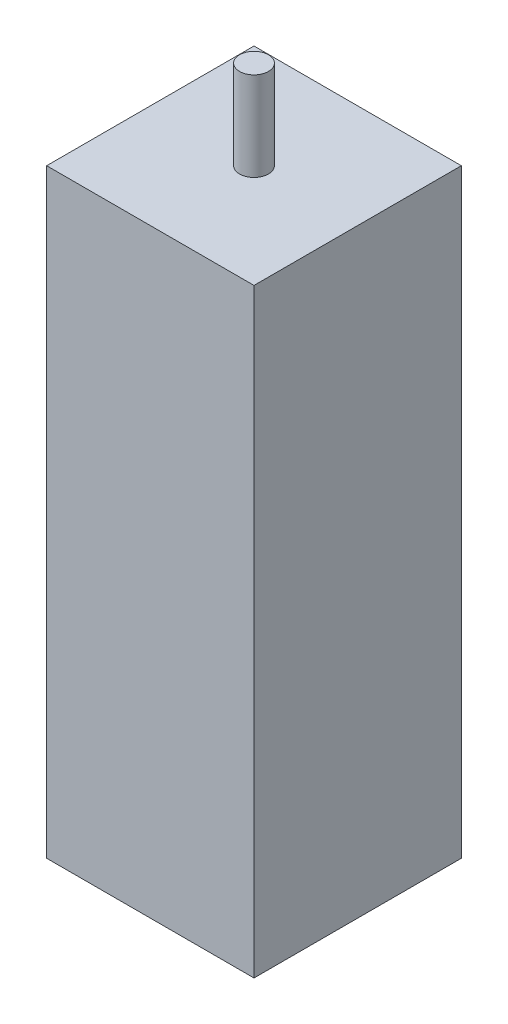
ISO-10303-21;
HEADER;
FILE_DESCRIPTION(('STEP AP214'),'2;1');
FILE_NAME('part.step','',(''),(''),'','','');
FILE_SCHEMA(('AUTOMOTIVE_DESIGN { 1 0 10303 214 1 1 1 1 }'));
ENDSEC;
DATA;
#1=APPLICATION_CONTEXT('core data for automotive mechanical design processes');
#2=APPLICATION_PROTOCOL_DEFINITION('international standard','automotive_design',2000,#1);
#3=PRODUCT_CONTEXT('',#1,'mechanical');
#4=PRODUCT('Part','Part','',(#3));
#5=PRODUCT_RELATED_PRODUCT_CATEGORY('part','',(#4));
#6=PRODUCT_DEFINITION_FORMATION('','',#4);
#7=PRODUCT_DEFINITION_CONTEXT('part definition',#1,'design');
#8=PRODUCT_DEFINITION('design','',#6,#7);
#9=PRODUCT_DEFINITION_SHAPE('','',#8);
#10=(LENGTH_UNIT() NAMED_UNIT(*) SI_UNIT(.MILLI.,.METRE.));
#11=(NAMED_UNIT(*) PLANE_ANGLE_UNIT() SI_UNIT($,.RADIAN.));
#12=(NAMED_UNIT(*) SI_UNIT($,.STERADIAN.) SOLID_ANGLE_UNIT());
#13=UNCERTAINTY_MEASURE_WITH_UNIT(LENGTH_MEASURE(1.E-05),#10,'distance_accuracy_value','');
#14=(GEOMETRIC_REPRESENTATION_CONTEXT(3) GLOBAL_UNCERTAINTY_ASSIGNED_CONTEXT((#13)) GLOBAL_UNIT_ASSIGNED_CONTEXT((#10,
#11,#12)) REPRESENTATION_CONTEXT('',''));
#15=CARTESIAN_POINT('',(0.,0.,0.));
#16=DIRECTION('',(0.,0.,1.));
#17=DIRECTION('',(1.,0.,0.));
#18=AXIS2_PLACEMENT_3D('',#15,#16,#17);
#19=CARTESIAN_POINT('',(29.0000000745058,71.,71.0000014156103));
#20=DIRECTION('',(0.,1.,0.));
#21=DIRECTION('',(1.,0.,0.));
#22=AXIS2_PLACEMENT_3D('',#19,#20,#21);
#23=PLANE('',#22);
#24=CARTESIAN_POINT('',(29.0000000745058,71.,71.0000014156103));
#25=DIRECTION('',(0.,-1.,0.));
#26=DIRECTION('',(-1.,0.,0.));
#27=AXIS2_PLACEMENT_3D('',#24,#25,#26);
#28=CIRCLE('',#27,3.);
#29=CARTESIAN_POINT('',(32.0000000745058,71.,71.0000014156103));
#30=VERTEX_POINT('',#29);
#31=EDGE_CURVE('E162',#30,#30,#28,.T.);
#32=ORIENTED_EDGE('',*,*,#31,.F.);
#33=EDGE_LOOP('',(#32));
#34=FACE_BOUND('',#33,.T.);
#35=CARTESIAN_POINT('',(29.0000000745058,71.,71.0000014156103));
#36=DIRECTION('',(0.,1.,0.));
#37=DIRECTION('',(-1.,0.,0.));
#38=AXIS2_PLACEMENT_3D('',#35,#36,#37);
#39=CIRCLE('',#38,8.5);
#40=CARTESIAN_POINT('',(37.5000000745058,71.,71.0000014156103));
#41=VERTEX_POINT('',#40);
#42=EDGE_CURVE('E11',#41,#41,#39,.T.);
#43=ORIENTED_EDGE('',*,*,#42,.F.);
#44=EDGE_LOOP('',(#43));
#45=FACE_BOUND('',#44,.T.);
#46=ADVANCED_FACE('F17',(#34,#45),#23,.F.);
#47=CARTESIAN_POINT('',(29.0000000745058,71.,71.0000014156103));
#48=DIRECTION('',(0.,1.,0.));
#49=DIRECTION('',(-1.,0.,0.));
#50=AXIS2_PLACEMENT_3D('',#47,#48,#49);
#51=CYLINDRICAL_SURFACE('',#50,8.5);
#52=CARTESIAN_POINT('',(29.0000000745058,73.,71.0000014156103));
#53=DIRECTION('',(0.,1.,0.));
#54=DIRECTION('',(-1.,0.,0.));
#55=AXIS2_PLACEMENT_3D('',#52,#53,#54);
#56=CIRCLE('',#55,8.5);
#57=CARTESIAN_POINT('',(37.5000000745058,73.,71.0000014156103));
#58=VERTEX_POINT('',#57);
#59=EDGE_CURVE('E123',#58,#58,#56,.T.);
#60=ORIENTED_EDGE('',*,*,#59,.F.);
#61=DIRECTION('',(0.,-1.,0.));
#62=VECTOR('',#61,1.);
#63=CARTESIAN_POINT('',(37.5000000745058,71.,71.0000014156103));
#64=LINE('',#63,#62);
#65=EDGE_CURVE('E28',#58,#41,#64,.T.);
#66=ORIENTED_EDGE('',*,*,#65,.T.);
#67=ORIENTED_EDGE('',*,*,#42,.T.);
#68=ORIENTED_EDGE('',*,*,#65,.F.);
#69=EDGE_LOOP('',(#60,#66,#67,#68));
#70=FACE_BOUND('',#69,.T.);
#71=ADVANCED_FACE('F181',(#70),#51,.T.);
#72=CARTESIAN_POINT('',(29.0000000745058,71.,71.0000014156103));
#73=DIRECTION('',(0.,1.,0.));
#74=DIRECTION('',(-1.,0.,0.));
#75=AXIS2_PLACEMENT_3D('',#72,#73,#74);
#76=CYLINDRICAL_SURFACE('',#75,3.);
#77=ORIENTED_EDGE('',*,*,#31,.T.);
#78=DIRECTION('',(0.,1.,0.));
#79=VECTOR('',#78,1.);
#80=CARTESIAN_POINT('',(32.0000000745058,71.,71.0000014156103));
#81=LINE('',#80,#79);
#82=CARTESIAN_POINT('',(32.0000000745058,73.,71.0000014156103));
#83=VERTEX_POINT('',#82);
#84=EDGE_CURVE('E21',#30,#83,#81,.T.);
#85=ORIENTED_EDGE('',*,*,#84,.T.);
#86=CARTESIAN_POINT('',(29.0000000745058,73.,71.0000014156103));
#87=DIRECTION('',(0.,-1.,0.));
#88=DIRECTION('',(-1.,0.,0.));
#89=AXIS2_PLACEMENT_3D('',#86,#87,#88);
#90=CIRCLE('',#89,3.);
#91=EDGE_CURVE('E144',#83,#83,#90,.T.);
#92=ORIENTED_EDGE('',*,*,#91,.F.);
#93=ORIENTED_EDGE('',*,*,#84,.F.);
#94=EDGE_LOOP('',(#77,#85,#92,#93));
#95=FACE_BOUND('',#94,.T.);
#96=ADVANCED_FACE('F183',(#95),#76,.F.);
#97=CARTESIAN_POINT('',(29.0000000745058,154.,71.0000014156103));
#98=DIRECTION('',(0.,1.,0.));
#99=DIRECTION('',(1.,0.,0.));
#100=AXIS2_PLACEMENT_3D('',#97,#98,#99);
#101=PLANE('',#100);
#102=CARTESIAN_POINT('',(29.0000000745058,154.,71.0000014156103));
#103=DIRECTION('',(0.,-1.,0.));
#104=DIRECTION('',(-1.,0.,0.));
#105=AXIS2_PLACEMENT_3D('',#102,#103,#104);
#106=CIRCLE('',#105,1.95);
#107=CARTESIAN_POINT('',(30.9500000745058,154.,71.0000014156103));
#108=VERTEX_POINT('',#107);
#109=EDGE_CURVE('E78',#108,#108,#106,.T.);
#110=ORIENTED_EDGE('',*,*,#109,.T.);
#111=EDGE_LOOP('',(#110));
#112=FACE_BOUND('',#111,.T.);
#113=DIRECTION('',(0.,0.,1.));
#114=VECTOR('',#113,1.);
#115=CARTESIAN_POINT('',(15.0000000745058,154.,57.0000014156103));
#116=LINE('',#115,#114);
#117=CARTESIAN_POINT('',(15.0000000745058,154.,57.0000014156103));
#118=VERTEX_POINT('',#117);
#119=CARTESIAN_POINT('',(15.0000000745058,154.,85.0000014156103));
#120=VERTEX_POINT('',#119);
#121=EDGE_CURVE('E143',#118,#120,#116,.T.);
#122=ORIENTED_EDGE('',*,*,#121,.T.);
#123=DIRECTION('',(1.,0.,0.));
#124=VECTOR('',#123,1.);
#125=CARTESIAN_POINT('',(15.0000000745058,154.,85.0000014156103));
#126=LINE('',#125,#124);
#127=CARTESIAN_POINT('',(43.0000000745058,154.,85.0000014156103));
#128=VERTEX_POINT('',#127);
#129=EDGE_CURVE('E113',#120,#128,#126,.T.);
#130=ORIENTED_EDGE('',*,*,#129,.T.);
#131=DIRECTION('',(0.,0.,-1.));
#132=VECTOR('',#131,1.);
#133=CARTESIAN_POINT('',(43.0000000745058,154.,85.0000014156103));
#134=LINE('',#133,#132);
#135=CARTESIAN_POINT('',(43.0000000745058,154.,57.0000014156103));
#136=VERTEX_POINT('',#135);
#137=EDGE_CURVE('E109',#128,#136,#134,.T.);
#138=ORIENTED_EDGE('',*,*,#137,.T.);
#139=DIRECTION('',(-1.,0.,0.));
#140=VECTOR('',#139,1.);
#141=CARTESIAN_POINT('',(43.0000000745058,154.,57.0000014156103));
#142=LINE('',#141,#140);
#143=EDGE_CURVE('E136',#136,#118,#142,.T.);
#144=ORIENTED_EDGE('',*,*,#143,.T.);
#145=EDGE_LOOP('',(#122,#130,#138,#144));
#146=FACE_BOUND('',#145,.T.);
#147=ADVANCED_FACE('F190',(#112,#146),#101,.T.);
#148=CARTESIAN_POINT('',(15.0000000745058,73.,57.0000014156103));
#149=DIRECTION('',(-1.,0.,0.));
#150=DIRECTION('',(0.,0.,1.));
#151=AXIS2_PLACEMENT_3D('',#148,#149,#150);
#152=PLANE('',#151);
#153=DIRECTION('',(0.,0.,1.));
#154=VECTOR('',#153,1.);
#155=CARTESIAN_POINT('',(15.0000000745058,73.,57.0000014156103));
#156=LINE('',#155,#154);
#157=CARTESIAN_POINT('',(15.0000000745058,73.,57.0000014156103));
#158=VERTEX_POINT('',#157);
#159=CARTESIAN_POINT('',(15.0000000745058,73.,85.0000014156103));
#160=VERTEX_POINT('',#159);
#161=EDGE_CURVE('E133',#158,#160,#156,.T.);
#162=ORIENTED_EDGE('',*,*,#161,.T.);
#163=DIRECTION('',(0.,1.,0.));
#164=VECTOR('',#163,1.);
#165=CARTESIAN_POINT('',(15.0000000745058,73.,85.0000014156103));
#166=LINE('',#165,#164);
#167=EDGE_CURVE('E119',#160,#120,#166,.T.);
#168=ORIENTED_EDGE('',*,*,#167,.T.);
#169=ORIENTED_EDGE('',*,*,#121,.F.);
#170=DIRECTION('',(0.,1.,0.));
#171=VECTOR('',#170,1.);
#172=CARTESIAN_POINT('',(15.0000000745058,73.,57.0000014156103));
#173=LINE('',#172,#171);
#174=EDGE_CURVE('E65',#158,#118,#173,.T.);
#175=ORIENTED_EDGE('',*,*,#174,.F.);
#176=EDGE_LOOP('',(#162,#168,#169,#175));
#177=FACE_BOUND('',#176,.T.);
#178=ADVANCED_FACE('F202',(#177),#152,.T.);
#179=CARTESIAN_POINT('',(15.0000000745058,73.,85.0000014156103));
#180=DIRECTION('',(0.,0.,1.));
#181=DIRECTION('',(1.,0.,0.));
#182=AXIS2_PLACEMENT_3D('',#179,#180,#181);
#183=PLANE('',#182);
#184=DIRECTION('',(1.,0.,0.));
#185=VECTOR('',#184,1.);
#186=CARTESIAN_POINT('',(15.0000000745058,73.,85.0000014156103));
#187=LINE('',#186,#185);
#188=CARTESIAN_POINT('',(43.0000000745058,73.,85.0000014156103));
#189=VERTEX_POINT('',#188);
#190=EDGE_CURVE('E116',#160,#189,#187,.T.);
#191=ORIENTED_EDGE('',*,*,#190,.T.);
#192=DIRECTION('',(0.,1.,0.));
#193=VECTOR('',#192,1.);
#194=CARTESIAN_POINT('',(43.0000000745058,73.,85.0000014156103));
#195=LINE('',#194,#193);
#196=EDGE_CURVE('E101',#189,#128,#195,.T.);
#197=ORIENTED_EDGE('',*,*,#196,.T.);
#198=ORIENTED_EDGE('',*,*,#129,.F.);
#199=ORIENTED_EDGE('',*,*,#167,.F.);
#200=EDGE_LOOP('',(#191,#197,#198,#199));
#201=FACE_BOUND('',#200,.T.);
#202=ADVANCED_FACE('F117',(#201),#183,.T.);
#203=CARTESIAN_POINT('',(43.0000000745058,73.,85.0000014156103));
#204=DIRECTION('',(1.,0.,0.));
#205=DIRECTION('',(0.,1.,0.));
#206=AXIS2_PLACEMENT_3D('',#203,#204,#205);
#207=PLANE('',#206);
#208=DIRECTION('',(0.,0.,-1.));
#209=VECTOR('',#208,1.);
#210=CARTESIAN_POINT('',(43.0000000745058,73.,85.0000014156103));
#211=LINE('',#210,#209);
#212=CARTESIAN_POINT('',(43.0000000745058,73.,57.0000014156103));
#213=VERTEX_POINT('',#212);
#214=EDGE_CURVE('E106',#189,#213,#211,.T.);
#215=ORIENTED_EDGE('',*,*,#214,.T.);
#216=DIRECTION('',(0.,1.,0.));
#217=VECTOR('',#216,1.);
#218=CARTESIAN_POINT('',(43.0000000745058,73.,57.0000014156103));
#219=LINE('',#218,#217);
#220=EDGE_CURVE('E139',#213,#136,#219,.T.);
#221=ORIENTED_EDGE('',*,*,#220,.T.);
#222=ORIENTED_EDGE('',*,*,#137,.F.);
#223=ORIENTED_EDGE('',*,*,#196,.F.);
#224=EDGE_LOOP('',(#215,#221,#222,#223));
#225=FACE_BOUND('',#224,.T.);
#226=ADVANCED_FACE('F103',(#225),#207,.T.);
#227=CARTESIAN_POINT('',(43.0000000745058,73.,57.0000014156103));
#228=DIRECTION('',(0.,0.,-1.));
#229=DIRECTION('',(0.,-1.,0.));
#230=AXIS2_PLACEMENT_3D('',#227,#228,#229);
#231=PLANE('',#230);
#232=DIRECTION('',(-1.,0.,0.));
#233=VECTOR('',#232,1.);
#234=CARTESIAN_POINT('',(43.0000000745058,73.,57.0000014156103));
#235=LINE('',#234,#233);
#236=EDGE_CURVE('E126',#213,#158,#235,.T.);
#237=ORIENTED_EDGE('',*,*,#236,.T.);
#238=ORIENTED_EDGE('',*,*,#174,.T.);
#239=ORIENTED_EDGE('',*,*,#143,.F.);
#240=ORIENTED_EDGE('',*,*,#220,.F.);
#241=EDGE_LOOP('',(#237,#238,#239,#240));
#242=FACE_BOUND('',#241,.T.);
#243=ADVANCED_FACE('F196',(#242),#231,.T.);
#244=CARTESIAN_POINT('',(29.0000000745058,73.,71.0000014156103));
#245=DIRECTION('',(0.,1.,0.));
#246=DIRECTION('',(1.,0.,0.));
#247=AXIS2_PLACEMENT_3D('',#244,#245,#246);
#248=PLANE('',#247);
#249=ORIENTED_EDGE('',*,*,#91,.T.);
#250=EDGE_LOOP('',(#249));
#251=FACE_BOUND('',#250,.T.);
#252=ADVANCED_FACE('F19',(#251),#248,.F.);
#253=CARTESIAN_POINT('',(29.0000000745058,73.,71.0000014156103));
#254=DIRECTION('',(0.,1.,0.));
#255=DIRECTION('',(1.,0.,0.));
#256=AXIS2_PLACEMENT_3D('',#253,#254,#255);
#257=PLANE('',#256);
#258=ORIENTED_EDGE('',*,*,#59,.T.);
#259=EDGE_LOOP('',(#258));
#260=FACE_BOUND('',#259,.T.);
#261=ORIENTED_EDGE('',*,*,#161,.F.);
#262=ORIENTED_EDGE('',*,*,#236,.F.);
#263=ORIENTED_EDGE('',*,*,#214,.F.);
#264=ORIENTED_EDGE('',*,*,#190,.F.);
#265=EDGE_LOOP('',(#261,#262,#263,#264));
#266=FACE_BOUND('',#265,.T.);
#267=ADVANCED_FACE('F125',(#260,#266),#257,.F.);
#268=CARTESIAN_POINT('',(29.0000000745058,166.,71.0000014156103));
#269=DIRECTION('',(0.,1.,0.));
#270=DIRECTION('',(1.,0.,0.));
#271=AXIS2_PLACEMENT_3D('',#268,#269,#270);
#272=PLANE('',#271);
#273=CARTESIAN_POINT('',(29.0000000745058,166.,71.0000014156103));
#274=DIRECTION('',(0.,1.,0.));
#275=DIRECTION('',(-1.,0.,0.));
#276=AXIS2_PLACEMENT_3D('',#273,#274,#275);
#277=CIRCLE('',#276,1.95);
#278=CARTESIAN_POINT('',(30.9500000745058,166.,71.0000014156103));
#279=VERTEX_POINT('',#278);
#280=EDGE_CURVE('E154',#279,#279,#277,.T.);
#281=ORIENTED_EDGE('',*,*,#280,.T.);
#282=EDGE_LOOP('',(#281));
#283=FACE_BOUND('',#282,.T.);
#284=ADVANCED_FACE('F200',(#283),#272,.T.);
#285=CARTESIAN_POINT('',(29.0000000745058,154.,71.0000014156103));
#286=DIRECTION('',(0.,1.,0.));
#287=DIRECTION('',(-1.,0.,0.));
#288=AXIS2_PLACEMENT_3D('',#285,#286,#287);
#289=CYLINDRICAL_SURFACE('',#288,1.95);
#290=ORIENTED_EDGE('',*,*,#280,.F.);
#291=DIRECTION('',(0.,-1.,0.));
#292=VECTOR('',#291,1.);
#293=CARTESIAN_POINT('',(30.9500000745058,154.,71.0000014156103));
#294=LINE('',#293,#292);
#295=EDGE_CURVE('E158',#279,#108,#294,.T.);
#296=ORIENTED_EDGE('',*,*,#295,.T.);
#297=ORIENTED_EDGE('',*,*,#109,.F.);
#298=ORIENTED_EDGE('',*,*,#295,.F.);
#299=EDGE_LOOP('',(#290,#296,#297,#298));
#300=FACE_BOUND('',#299,.T.);
#301=ADVANCED_FACE('F226',(#300),#289,.T.);
#302=CLOSED_SHELL('',(#46,#71,#96,#147,#178,#202,#226,#243,#252,#267,#284,#301));
#303=MANIFOLD_SOLID_BREP('B1',#302);
#304=ADVANCED_BREP_SHAPE_REPRESENTATION('',(#18,#303),#14);
#305=SHAPE_DEFINITION_REPRESENTATION(#9,#304);
ENDSEC;
END-ISO-10303-21;
